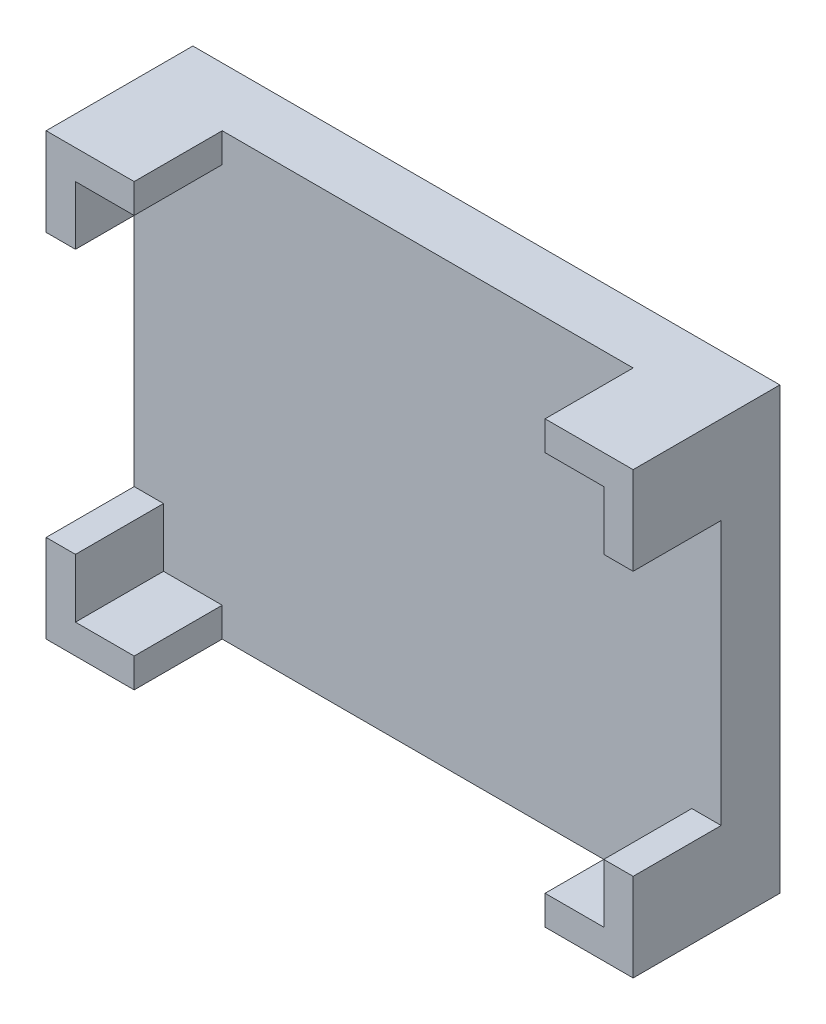
ISO-10303-21;
HEADER;
FILE_DESCRIPTION(('STEP AP214'),'2;1');
FILE_NAME('part.step','',(''),(''),'','','');
FILE_SCHEMA(('AUTOMOTIVE_DESIGN { 1 0 10303 214 1 1 1 1 }'));
ENDSEC;
DATA;
#1=APPLICATION_CONTEXT('core data for automotive mechanical design processes');
#2=APPLICATION_PROTOCOL_DEFINITION('international standard','automotive_design',2000,#1);
#3=PRODUCT_CONTEXT('',#1,'mechanical');
#4=PRODUCT('Part','Part','',(#3));
#5=PRODUCT_RELATED_PRODUCT_CATEGORY('part','',(#4));
#6=PRODUCT_DEFINITION_FORMATION('','',#4);
#7=PRODUCT_DEFINITION_CONTEXT('part definition',#1,'design');
#8=PRODUCT_DEFINITION('design','',#6,#7);
#9=PRODUCT_DEFINITION_SHAPE('','',#8);
#10=(LENGTH_UNIT() NAMED_UNIT(*) SI_UNIT(.MILLI.,.METRE.));
#11=(NAMED_UNIT(*) PLANE_ANGLE_UNIT() SI_UNIT($,.RADIAN.));
#12=(NAMED_UNIT(*) SI_UNIT($,.STERADIAN.) SOLID_ANGLE_UNIT());
#13=UNCERTAINTY_MEASURE_WITH_UNIT(LENGTH_MEASURE(1.E-05),#10,'distance_accuracy_value','');
#14=(GEOMETRIC_REPRESENTATION_CONTEXT(3) GLOBAL_UNCERTAINTY_ASSIGNED_CONTEXT((#13)) GLOBAL_UNIT_ASSIGNED_CONTEXT((#10,
#11,#12)) REPRESENTATION_CONTEXT('',''));
#15=CARTESIAN_POINT('',(0.,0.,0.));
#16=DIRECTION('',(0.,0.,1.));
#17=DIRECTION('',(1.,0.,0.));
#18=AXIS2_PLACEMENT_3D('',#15,#16,#17);
#19=CARTESIAN_POINT('',(0.,0.,2.));
#20=DIRECTION('',(0.,0.,-1.));
#21=DIRECTION('',(-1.,0.,0.));
#22=AXIS2_PLACEMENT_3D('',#19,#20,#21);
#23=PLANE('',#22);
#24=DIRECTION('',(-1.,0.,0.));
#25=VECTOR('',#24,1.);
#26=CARTESIAN_POINT('',(20.,3.,2.));
#27=LINE('',#26,#25);
#28=CARTESIAN_POINT('',(20.,3.,2.));
#29=VERTEX_POINT('',#28);
#30=CARTESIAN_POINT('',(19.,3.,2.));
#31=VERTEX_POINT('',#30);
#32=EDGE_CURVE('E210',#29,#31,#27,.T.);
#33=ORIENTED_EDGE('',*,*,#32,.F.);
#34=DIRECTION('',(0.,1.,0.));
#35=VECTOR('',#34,1.);
#36=CARTESIAN_POINT('',(20.,0.,2.));
#37=LINE('',#36,#35);
#38=CARTESIAN_POINT('',(20.,12.,2.));
#39=VERTEX_POINT('',#38);
#40=EDGE_CURVE('E198',#29,#39,#37,.T.);
#41=ORIENTED_EDGE('',*,*,#40,.T.);
#42=DIRECTION('',(-1.,0.,0.));
#43=VECTOR('',#42,1.);
#44=CARTESIAN_POINT('',(0.,12.,2.));
#45=LINE('',#44,#43);
#46=CARTESIAN_POINT('',(19.,12.,2.));
#47=VERTEX_POINT('',#46);
#48=EDGE_CURVE('E264',#39,#47,#45,.T.);
#49=ORIENTED_EDGE('',*,*,#48,.T.);
#50=DIRECTION('',(0.,-1.,0.));
#51=VECTOR('',#50,1.);
#52=CARTESIAN_POINT('',(19.,0.,2.));
#53=LINE('',#52,#51);
#54=CARTESIAN_POINT('',(19.,14.,2.));
#55=VERTEX_POINT('',#54);
#56=EDGE_CURVE('E267',#55,#47,#53,.T.);
#57=ORIENTED_EDGE('',*,*,#56,.F.);
#58=DIRECTION('',(-1.,0.,0.));
#59=VECTOR('',#58,1.);
#60=CARTESIAN_POINT('',(0.,14.,2.));
#61=LINE('',#60,#59);
#62=CARTESIAN_POINT('',(17.,14.,2.));
#63=VERTEX_POINT('',#62);
#64=EDGE_CURVE('E270',#55,#63,#61,.T.);
#65=ORIENTED_EDGE('',*,*,#64,.T.);
#66=DIRECTION('',(0.,-1.,0.));
#67=VECTOR('',#66,1.);
#68=CARTESIAN_POINT('',(17.,0.,2.));
#69=LINE('',#68,#67);
#70=CARTESIAN_POINT('',(17.,15.,2.));
#71=VERTEX_POINT('',#70);
#72=EDGE_CURVE('E261',#71,#63,#69,.T.);
#73=ORIENTED_EDGE('',*,*,#72,.F.);
#74=DIRECTION('',(-1.,0.,0.));
#75=VECTOR('',#74,1.);
#76=CARTESIAN_POINT('',(0.,15.,2.));
#77=LINE('',#76,#75);
#78=CARTESIAN_POINT('',(3.,15.,2.));
#79=VERTEX_POINT('',#78);
#80=EDGE_CURVE('E206',#71,#79,#77,.T.);
#81=ORIENTED_EDGE('',*,*,#80,.T.);
#82=DIRECTION('',(0.,-1.,0.));
#83=VECTOR('',#82,1.);
#84=CARTESIAN_POINT('',(3.,0.,2.));
#85=LINE('',#84,#83);
#86=CARTESIAN_POINT('',(3.,14.,2.));
#87=VERTEX_POINT('',#86);
#88=EDGE_CURVE('E312',#79,#87,#85,.T.);
#89=ORIENTED_EDGE('',*,*,#88,.T.);
#90=DIRECTION('',(1.,0.,0.));
#91=VECTOR('',#90,1.);
#92=CARTESIAN_POINT('',(0.,14.,2.));
#93=LINE('',#92,#91);
#94=CARTESIAN_POINT('',(1.,14.,2.));
#95=VERTEX_POINT('',#94);
#96=EDGE_CURVE('E331',#95,#87,#93,.T.);
#97=ORIENTED_EDGE('',*,*,#96,.F.);
#98=DIRECTION('',(0.,-1.,0.));
#99=VECTOR('',#98,1.);
#100=CARTESIAN_POINT('',(1.,0.,2.));
#101=LINE('',#100,#99);
#102=CARTESIAN_POINT('',(1.,12.,2.));
#103=VERTEX_POINT('',#102);
#104=EDGE_CURVE('E348',#95,#103,#101,.T.);
#105=ORIENTED_EDGE('',*,*,#104,.T.);
#106=DIRECTION('',(1.,0.,0.));
#107=VECTOR('',#106,1.);
#108=CARTESIAN_POINT('',(0.,12.,2.));
#109=LINE('',#108,#107);
#110=CARTESIAN_POINT('',(0.,12.,2.));
#111=VERTEX_POINT('',#110);
#112=EDGE_CURVE('E345',#111,#103,#109,.T.);
#113=ORIENTED_EDGE('',*,*,#112,.F.);
#114=DIRECTION('',(0.,-1.,0.));
#115=VECTOR('',#114,1.);
#116=CARTESIAN_POINT('',(0.,0.,2.));
#117=LINE('',#116,#115);
#118=CARTESIAN_POINT('',(0.,3.,2.));
#119=VERTEX_POINT('',#118);
#120=EDGE_CURVE('E367',#111,#119,#117,.T.);
#121=ORIENTED_EDGE('',*,*,#120,.T.);
#122=DIRECTION('',(1.,0.,0.));
#123=VECTOR('',#122,1.);
#124=CARTESIAN_POINT('',(0.,3.,2.));
#125=LINE('',#124,#123);
#126=CARTESIAN_POINT('',(1.,3.,2.));
#127=VERTEX_POINT('',#126);
#128=EDGE_CURVE('E301',#119,#127,#125,.T.);
#129=ORIENTED_EDGE('',*,*,#128,.T.);
#130=DIRECTION('',(0.,1.,0.));
#131=VECTOR('',#130,1.);
#132=CARTESIAN_POINT('',(1.,0.,2.));
#133=LINE('',#132,#131);
#134=CARTESIAN_POINT('',(1.,1.,2.));
#135=VERTEX_POINT('',#134);
#136=EDGE_CURVE('E303',#135,#127,#133,.T.);
#137=ORIENTED_EDGE('',*,*,#136,.F.);
#138=DIRECTION('',(1.,0.,0.));
#139=VECTOR('',#138,1.);
#140=CARTESIAN_POINT('',(0.,1.,2.));
#141=LINE('',#140,#139);
#142=CARTESIAN_POINT('',(3.,1.,2.));
#143=VERTEX_POINT('',#142);
#144=EDGE_CURVE('E307',#135,#143,#141,.T.);
#145=ORIENTED_EDGE('',*,*,#144,.T.);
#146=DIRECTION('',(0.,1.,0.));
#147=VECTOR('',#146,1.);
#148=CARTESIAN_POINT('',(3.,0.,2.));
#149=LINE('',#148,#147);
#150=CARTESIAN_POINT('',(3.,0.,2.));
#151=VERTEX_POINT('',#150);
#152=EDGE_CURVE('E309',#151,#143,#149,.T.);
#153=ORIENTED_EDGE('',*,*,#152,.F.);
#154=DIRECTION('',(1.,0.,0.));
#155=VECTOR('',#154,1.);
#156=CARTESIAN_POINT('',(0.,0.,2.));
#157=LINE('',#156,#155);
#158=CARTESIAN_POINT('',(17.,0.,2.));
#159=VERTEX_POINT('',#158);
#160=EDGE_CURVE('E207',#151,#159,#157,.T.);
#161=ORIENTED_EDGE('',*,*,#160,.T.);
#162=DIRECTION('',(0.,1.,0.));
#163=VECTOR('',#162,1.);
#164=CARTESIAN_POINT('',(17.,0.,2.));
#165=LINE('',#164,#163);
#166=CARTESIAN_POINT('',(17.,1.,2.));
#167=VERTEX_POINT('',#166);
#168=EDGE_CURVE('E231',#159,#167,#165,.T.);
#169=ORIENTED_EDGE('',*,*,#168,.T.);
#170=DIRECTION('',(-1.,0.,0.));
#171=VECTOR('',#170,1.);
#172=CARTESIAN_POINT('',(19.,1.,2.));
#173=LINE('',#172,#171);
#174=CARTESIAN_POINT('',(19.,1.,2.));
#175=VERTEX_POINT('',#174);
#176=EDGE_CURVE('E57',#175,#167,#173,.T.);
#177=ORIENTED_EDGE('',*,*,#176,.F.);
#178=DIRECTION('',(0.,1.,0.));
#179=VECTOR('',#178,1.);
#180=CARTESIAN_POINT('',(19.,1.,2.));
#181=LINE('',#180,#179);
#182=EDGE_CURVE('E52',#175,#31,#181,.T.);
#183=ORIENTED_EDGE('',*,*,#182,.T.);
#184=EDGE_LOOP('',(#33,#41,#49,#57,#65,#73,#81,#89,#97,#105,#113,#121,#129,#137,#145,#153,#161,
#169,#177,#183));
#185=FACE_BOUND('',#184,.T.);
#186=ADVANCED_FACE('F37',(#185),#23,.F.);
#187=CARTESIAN_POINT('',(0.,0.,2.));
#188=DIRECTION('',(1.,0.,0.));
#189=DIRECTION('',(0.,1.,0.));
#190=AXIS2_PLACEMENT_3D('',#187,#188,#189);
#191=PLANE('',#190);
#192=DIRECTION('',(0.,-1.,0.));
#193=VECTOR('',#192,1.);
#194=CARTESIAN_POINT('',(0.,0.,0.));
#195=LINE('',#194,#193);
#196=CARTESIAN_POINT('',(0.,15.,0.));
#197=VERTEX_POINT('',#196);
#198=CARTESIAN_POINT('',(0.,0.,0.));
#199=VERTEX_POINT('',#198);
#200=EDGE_CURVE('E366',#197,#199,#195,.T.);
#201=ORIENTED_EDGE('',*,*,#200,.T.);
#202=DIRECTION('',(0.,0.,-1.));
#203=VECTOR('',#202,1.);
#204=CARTESIAN_POINT('',(0.,0.,2.));
#205=LINE('',#204,#203);
#206=CARTESIAN_POINT('',(0.,0.,5.));
#207=VERTEX_POINT('',#206);
#208=EDGE_CURVE('E11',#207,#199,#205,.T.);
#209=ORIENTED_EDGE('',*,*,#208,.F.);
#210=DIRECTION('',(0.,-1.,0.));
#211=VECTOR('',#210,1.);
#212=CARTESIAN_POINT('',(0.,0.,5.));
#213=LINE('',#212,#211);
#214=CARTESIAN_POINT('',(0.,3.,5.));
#215=VERTEX_POINT('',#214);
#216=EDGE_CURVE('E300',#215,#207,#213,.T.);
#217=ORIENTED_EDGE('',*,*,#216,.F.);
#218=DIRECTION('',(0.,0.,-1.));
#219=VECTOR('',#218,1.);
#220=CARTESIAN_POINT('',(0.,3.,5.));
#221=LINE('',#220,#219);
#222=EDGE_CURVE('E297',#215,#119,#221,.T.);
#223=ORIENTED_EDGE('',*,*,#222,.T.);
#224=ORIENTED_EDGE('',*,*,#120,.F.);
#225=DIRECTION('',(0.,0.,-1.));
#226=VECTOR('',#225,1.);
#227=CARTESIAN_POINT('',(0.,12.,5.));
#228=LINE('',#227,#226);
#229=CARTESIAN_POINT('',(0.,12.,5.));
#230=VERTEX_POINT('',#229);
#231=EDGE_CURVE('E360',#230,#111,#228,.T.);
#232=ORIENTED_EDGE('',*,*,#231,.F.);
#233=DIRECTION('',(0.,-1.,0.));
#234=VECTOR('',#233,1.);
#235=CARTESIAN_POINT('',(0.,0.,5.));
#236=LINE('',#235,#234);
#237=CARTESIAN_POINT('',(0.,15.,5.));
#238=VERTEX_POINT('',#237);
#239=EDGE_CURVE('E334',#238,#230,#236,.T.);
#240=ORIENTED_EDGE('',*,*,#239,.F.);
#241=DIRECTION('',(0.,0.,-1.));
#242=VECTOR('',#241,1.);
#243=CARTESIAN_POINT('',(0.,15.,2.));
#244=LINE('',#243,#242);
#245=EDGE_CURVE('E372',#238,#197,#244,.T.);
#246=ORIENTED_EDGE('',*,*,#245,.T.);
#247=EDGE_LOOP('',(#201,#209,#217,#223,#224,#232,#240,#246));
#248=FACE_BOUND('',#247,.T.);
#249=ADVANCED_FACE('F39',(#248),#191,.F.);
#250=CARTESIAN_POINT('',(0.,0.,2.));
#251=DIRECTION('',(0.,1.,0.));
#252=DIRECTION('',(0.,0.,1.));
#253=AXIS2_PLACEMENT_3D('',#250,#251,#252);
#254=PLANE('',#253);
#255=DIRECTION('',(1.,0.,0.));
#256=VECTOR('',#255,1.);
#257=CARTESIAN_POINT('',(0.,0.,0.));
#258=LINE('',#257,#256);
#259=CARTESIAN_POINT('',(20.,0.,0.));
#260=VERTEX_POINT('',#259);
#261=EDGE_CURVE('E375',#199,#260,#258,.T.);
#262=ORIENTED_EDGE('',*,*,#261,.T.);
#263=DIRECTION('',(0.,0.,-1.));
#264=VECTOR('',#263,1.);
#265=CARTESIAN_POINT('',(20.,0.,2.));
#266=LINE('',#265,#264);
#267=CARTESIAN_POINT('',(20.,0.,5.));
#268=VERTEX_POINT('',#267);
#269=EDGE_CURVE('E45',#268,#260,#266,.T.);
#270=ORIENTED_EDGE('',*,*,#269,.F.);
#271=DIRECTION('',(-1.,0.,0.));
#272=VECTOR('',#271,1.);
#273=CARTESIAN_POINT('',(20.,0.,5.));
#274=LINE('',#273,#272);
#275=CARTESIAN_POINT('',(17.,0.,5.));
#276=VERTEX_POINT('',#275);
#277=EDGE_CURVE('E230',#268,#276,#274,.T.);
#278=ORIENTED_EDGE('',*,*,#277,.T.);
#279=DIRECTION('',(0.,0.,-1.));
#280=VECTOR('',#279,1.);
#281=CARTESIAN_POINT('',(17.,0.,5.));
#282=LINE('',#281,#280);
#283=EDGE_CURVE('E227',#276,#159,#282,.T.);
#284=ORIENTED_EDGE('',*,*,#283,.T.);
#285=ORIENTED_EDGE('',*,*,#160,.F.);
#286=DIRECTION('',(0.,0.,-1.));
#287=VECTOR('',#286,1.);
#288=CARTESIAN_POINT('',(3.,0.,5.));
#289=LINE('',#288,#287);
#290=CARTESIAN_POINT('',(3.,0.,5.));
#291=VERTEX_POINT('',#290);
#292=EDGE_CURVE('E272',#291,#151,#289,.T.);
#293=ORIENTED_EDGE('',*,*,#292,.F.);
#294=DIRECTION('',(1.,0.,0.));
#295=VECTOR('',#294,1.);
#296=CARTESIAN_POINT('',(0.,0.,5.));
#297=LINE('',#296,#295);
#298=EDGE_CURVE('E304',#207,#291,#297,.T.);
#299=ORIENTED_EDGE('',*,*,#298,.F.);
#300=ORIENTED_EDGE('',*,*,#208,.T.);
#301=EDGE_LOOP('',(#262,#270,#278,#284,#285,#293,#299,#300));
#302=FACE_BOUND('',#301,.T.);
#303=ADVANCED_FACE('F446',(#302),#254,.F.);
#304=CARTESIAN_POINT('',(20.,0.,2.));
#305=DIRECTION('',(-1.,0.,0.));
#306=DIRECTION('',(0.,-1.,0.));
#307=AXIS2_PLACEMENT_3D('',#304,#305,#306);
#308=PLANE('',#307);
#309=DIRECTION('',(0.,1.,0.));
#310=VECTOR('',#309,1.);
#311=CARTESIAN_POINT('',(20.,0.,0.));
#312=LINE('',#311,#310);
#313=CARTESIAN_POINT('',(20.,15.,0.));
#314=VERTEX_POINT('',#313);
#315=EDGE_CURVE('E377',#260,#314,#312,.T.);
#316=ORIENTED_EDGE('',*,*,#315,.T.);
#317=DIRECTION('',(0.,0.,-1.));
#318=VECTOR('',#317,1.);
#319=CARTESIAN_POINT('',(20.,15.,2.));
#320=LINE('',#319,#318);
#321=CARTESIAN_POINT('',(20.,15.,5.));
#322=VERTEX_POINT('',#321);
#323=EDGE_CURVE('E382',#322,#314,#320,.T.);
#324=ORIENTED_EDGE('',*,*,#323,.F.);
#325=DIRECTION('',(0.,1.,0.));
#326=VECTOR('',#325,1.);
#327=CARTESIAN_POINT('',(20.,0.,5.));
#328=LINE('',#327,#326);
#329=CARTESIAN_POINT('',(20.,12.,5.));
#330=VERTEX_POINT('',#329);
#331=EDGE_CURVE('E276',#330,#322,#328,.T.);
#332=ORIENTED_EDGE('',*,*,#331,.F.);
#333=DIRECTION('',(0.,0.,-1.));
#334=VECTOR('',#333,1.);
#335=CARTESIAN_POINT('',(20.,12.,5.));
#336=LINE('',#335,#334);
#337=EDGE_CURVE('E204',#330,#39,#336,.T.);
#338=ORIENTED_EDGE('',*,*,#337,.T.);
#339=ORIENTED_EDGE('',*,*,#40,.F.);
#340=DIRECTION('',(0.,0.,-1.));
#341=VECTOR('',#340,1.);
#342=CARTESIAN_POINT('',(20.,3.,5.));
#343=LINE('',#342,#341);
#344=CARTESIAN_POINT('',(20.,3.,5.));
#345=VERTEX_POINT('',#344);
#346=EDGE_CURVE('E202',#345,#29,#343,.T.);
#347=ORIENTED_EDGE('',*,*,#346,.F.);
#348=DIRECTION('',(0.,1.,0.));
#349=VECTOR('',#348,1.);
#350=CARTESIAN_POINT('',(20.,0.,5.));
#351=LINE('',#350,#349);
#352=EDGE_CURVE('E233',#268,#345,#351,.T.);
#353=ORIENTED_EDGE('',*,*,#352,.F.);
#354=ORIENTED_EDGE('',*,*,#269,.T.);
#355=EDGE_LOOP('',(#316,#324,#332,#338,#339,#347,#353,#354));
#356=FACE_BOUND('',#355,.T.);
#357=ADVANCED_FACE('F199',(#356),#308,.F.);
#358=CARTESIAN_POINT('',(0.,15.,2.));
#359=DIRECTION('',(0.,-1.,0.));
#360=DIRECTION('',(0.,0.,-1.));
#361=AXIS2_PLACEMENT_3D('',#358,#359,#360);
#362=PLANE('',#361);
#363=DIRECTION('',(-1.,0.,0.));
#364=VECTOR('',#363,1.);
#365=CARTESIAN_POINT('',(0.,15.,0.));
#366=LINE('',#365,#364);
#367=EDGE_CURVE('E369',#314,#197,#366,.T.);
#368=ORIENTED_EDGE('',*,*,#367,.T.);
#369=ORIENTED_EDGE('',*,*,#245,.F.);
#370=DIRECTION('',(-1.,0.,0.));
#371=VECTOR('',#370,1.);
#372=CARTESIAN_POINT('',(0.,15.,5.));
#373=LINE('',#372,#371);
#374=CARTESIAN_POINT('',(3.,15.,5.));
#375=VERTEX_POINT('',#374);
#376=EDGE_CURVE('E330',#375,#238,#373,.T.);
#377=ORIENTED_EDGE('',*,*,#376,.F.);
#378=DIRECTION('',(0.,0.,-1.));
#379=VECTOR('',#378,1.);
#380=CARTESIAN_POINT('',(3.,15.,5.));
#381=LINE('',#380,#379);
#382=EDGE_CURVE('E363',#375,#79,#381,.T.);
#383=ORIENTED_EDGE('',*,*,#382,.T.);
#384=ORIENTED_EDGE('',*,*,#80,.F.);
#385=DIRECTION('',(0.,0.,-1.));
#386=VECTOR('',#385,1.);
#387=CARTESIAN_POINT('',(17.,15.,5.));
#388=LINE('',#387,#386);
#389=CARTESIAN_POINT('',(17.,15.,5.));
#390=VERTEX_POINT('',#389);
#391=EDGE_CURVE('E254',#390,#71,#388,.T.);
#392=ORIENTED_EDGE('',*,*,#391,.F.);
#393=DIRECTION('',(-1.,0.,0.));
#394=VECTOR('',#393,1.);
#395=CARTESIAN_POINT('',(0.,15.,5.));
#396=LINE('',#395,#394);
#397=EDGE_CURVE('E274',#322,#390,#396,.T.);
#398=ORIENTED_EDGE('',*,*,#397,.F.);
#399=ORIENTED_EDGE('',*,*,#323,.T.);
#400=EDGE_LOOP('',(#368,#369,#377,#383,#384,#392,#398,#399));
#401=FACE_BOUND('',#400,.T.);
#402=ADVANCED_FACE('F393',(#401),#362,.F.);
#403=CARTESIAN_POINT('',(0.,0.,0.));
#404=DIRECTION('',(0.,0.,-1.));
#405=DIRECTION('',(-1.,0.,0.));
#406=AXIS2_PLACEMENT_3D('',#403,#404,#405);
#407=PLANE('',#406);
#408=ORIENTED_EDGE('',*,*,#200,.F.);
#409=ORIENTED_EDGE('',*,*,#367,.F.);
#410=ORIENTED_EDGE('',*,*,#315,.F.);
#411=ORIENTED_EDGE('',*,*,#261,.F.);
#412=EDGE_LOOP('',(#408,#409,#410,#411));
#413=FACE_BOUND('',#412,.T.);
#414=ADVANCED_FACE('F391',(#413),#407,.T.);
#415=CARTESIAN_POINT('',(3.,0.,5.));
#416=DIRECTION('',(1.,0.,0.));
#417=DIRECTION('',(0.,0.,-1.));
#418=AXIS2_PLACEMENT_3D('',#415,#416,#417);
#419=PLANE('',#418);
#420=ORIENTED_EDGE('',*,*,#88,.F.);
#421=ORIENTED_EDGE('',*,*,#382,.F.);
#422=DIRECTION('',(0.,-1.,0.));
#423=VECTOR('',#422,1.);
#424=CARTESIAN_POINT('',(3.,0.,5.));
#425=LINE('',#424,#423);
#426=CARTESIAN_POINT('',(3.,14.,5.));
#427=VERTEX_POINT('',#426);
#428=EDGE_CURVE('E327',#375,#427,#425,.T.);
#429=ORIENTED_EDGE('',*,*,#428,.T.);
#430=DIRECTION('',(0.,0.,-1.));
#431=VECTOR('',#430,1.);
#432=CARTESIAN_POINT('',(3.,14.,5.));
#433=LINE('',#432,#431);
#434=EDGE_CURVE('E343',#427,#87,#433,.T.);
#435=ORIENTED_EDGE('',*,*,#434,.T.);
#436=EDGE_LOOP('',(#420,#421,#429,#435));
#437=FACE_BOUND('',#436,.T.);
#438=ADVANCED_FACE('F410',(#437),#419,.T.);
#439=CARTESIAN_POINT('',(0.,12.,5.));
#440=DIRECTION('',(0.,1.,0.));
#441=DIRECTION('',(0.,0.,1.));
#442=AXIS2_PLACEMENT_3D('',#439,#440,#441);
#443=PLANE('',#442);
#444=ORIENTED_EDGE('',*,*,#112,.T.);
#445=DIRECTION('',(0.,0.,-1.));
#446=VECTOR('',#445,1.);
#447=CARTESIAN_POINT('',(1.,12.,5.));
#448=LINE('',#447,#446);
#449=CARTESIAN_POINT('',(1.,12.,5.));
#450=VERTEX_POINT('',#449);
#451=EDGE_CURVE('E357',#450,#103,#448,.T.);
#452=ORIENTED_EDGE('',*,*,#451,.F.);
#453=DIRECTION('',(1.,0.,0.));
#454=VECTOR('',#453,1.);
#455=CARTESIAN_POINT('',(0.,12.,5.));
#456=LINE('',#455,#454);
#457=EDGE_CURVE('E336',#230,#450,#456,.T.);
#458=ORIENTED_EDGE('',*,*,#457,.F.);
#459=ORIENTED_EDGE('',*,*,#231,.T.);
#460=EDGE_LOOP('',(#444,#452,#458,#459));
#461=FACE_BOUND('',#460,.T.);
#462=ADVANCED_FACE('F468',(#461),#443,.F.);
#463=CARTESIAN_POINT('',(1.,0.,5.));
#464=DIRECTION('',(1.,0.,0.));
#465=DIRECTION('',(0.,1.,0.));
#466=AXIS2_PLACEMENT_3D('',#463,#464,#465);
#467=PLANE('',#466);
#468=ORIENTED_EDGE('',*,*,#104,.F.);
#469=DIRECTION('',(0.,0.,-1.));
#470=VECTOR('',#469,1.);
#471=CARTESIAN_POINT('',(1.,14.,5.));
#472=LINE('',#471,#470);
#473=CARTESIAN_POINT('',(1.,14.,5.));
#474=VERTEX_POINT('',#473);
#475=EDGE_CURVE('E354',#474,#95,#472,.T.);
#476=ORIENTED_EDGE('',*,*,#475,.F.);
#477=DIRECTION('',(0.,-1.,0.));
#478=VECTOR('',#477,1.);
#479=CARTESIAN_POINT('',(1.,0.,5.));
#480=LINE('',#479,#478);
#481=EDGE_CURVE('E338',#474,#450,#480,.T.);
#482=ORIENTED_EDGE('',*,*,#481,.T.);
#483=ORIENTED_EDGE('',*,*,#451,.T.);
#484=EDGE_LOOP('',(#468,#476,#482,#483));
#485=FACE_BOUND('',#484,.T.);
#486=ADVANCED_FACE('F471',(#485),#467,.T.);
#487=CARTESIAN_POINT('',(0.,14.,5.));
#488=DIRECTION('',(0.,1.,0.));
#489=DIRECTION('',(0.,0.,1.));
#490=AXIS2_PLACEMENT_3D('',#487,#488,#489);
#491=PLANE('',#490);
#492=ORIENTED_EDGE('',*,*,#96,.T.);
#493=ORIENTED_EDGE('',*,*,#434,.F.);
#494=DIRECTION('',(1.,0.,0.));
#495=VECTOR('',#494,1.);
#496=CARTESIAN_POINT('',(0.,14.,5.));
#497=LINE('',#496,#495);
#498=EDGE_CURVE('E341',#474,#427,#497,.T.);
#499=ORIENTED_EDGE('',*,*,#498,.F.);
#500=ORIENTED_EDGE('',*,*,#475,.T.);
#501=EDGE_LOOP('',(#492,#493,#499,#500));
#502=FACE_BOUND('',#501,.T.);
#503=ADVANCED_FACE('F474',(#502),#491,.F.);
#504=CARTESIAN_POINT('',(0.,0.,5.));
#505=DIRECTION('',(0.,0.,1.));
#506=DIRECTION('',(1.,0.,0.));
#507=AXIS2_PLACEMENT_3D('',#504,#505,#506);
#508=PLANE('',#507);
#509=ORIENTED_EDGE('',*,*,#428,.F.);
#510=ORIENTED_EDGE('',*,*,#376,.T.);
#511=ORIENTED_EDGE('',*,*,#239,.T.);
#512=ORIENTED_EDGE('',*,*,#457,.T.);
#513=ORIENTED_EDGE('',*,*,#481,.F.);
#514=ORIENTED_EDGE('',*,*,#498,.T.);
#515=EDGE_LOOP('',(#509,#510,#511,#512,#513,#514));
#516=FACE_BOUND('',#515,.T.);
#517=ADVANCED_FACE('F403',(#516),#508,.T.);
#518=CARTESIAN_POINT('',(3.,0.,5.));
#519=DIRECTION('',(-1.,0.,0.));
#520=DIRECTION('',(0.,0.,1.));
#521=AXIS2_PLACEMENT_3D('',#518,#519,#520);
#522=PLANE('',#521);
#523=ORIENTED_EDGE('',*,*,#152,.T.);
#524=DIRECTION('',(0.,0.,-1.));
#525=VECTOR('',#524,1.);
#526=CARTESIAN_POINT('',(3.,1.,5.));
#527=LINE('',#526,#525);
#528=CARTESIAN_POINT('',(3.,1.,5.));
#529=VERTEX_POINT('',#528);
#530=EDGE_CURVE('E288',#529,#143,#527,.T.);
#531=ORIENTED_EDGE('',*,*,#530,.F.);
#532=DIRECTION('',(0.,1.,0.));
#533=VECTOR('',#532,1.);
#534=CARTESIAN_POINT('',(3.,0.,5.));
#535=LINE('',#534,#533);
#536=EDGE_CURVE('E323',#291,#529,#535,.T.);
#537=ORIENTED_EDGE('',*,*,#536,.F.);
#538=ORIENTED_EDGE('',*,*,#292,.T.);
#539=EDGE_LOOP('',(#523,#531,#537,#538));
#540=FACE_BOUND('',#539,.T.);
#541=ADVANCED_FACE('F481',(#540),#522,.F.);
#542=CARTESIAN_POINT('',(0.,1.,5.));
#543=DIRECTION('',(0.,1.,0.));
#544=DIRECTION('',(0.,0.,1.));
#545=AXIS2_PLACEMENT_3D('',#542,#543,#544);
#546=PLANE('',#545);
#547=ORIENTED_EDGE('',*,*,#144,.F.);
#548=DIRECTION('',(0.,0.,-1.));
#549=VECTOR('',#548,1.);
#550=CARTESIAN_POINT('',(1.,1.,5.));
#551=LINE('',#550,#549);
#552=CARTESIAN_POINT('',(1.,1.,5.));
#553=VERTEX_POINT('',#552);
#554=EDGE_CURVE('E291',#553,#135,#551,.T.);
#555=ORIENTED_EDGE('',*,*,#554,.F.);
#556=DIRECTION('',(1.,0.,0.));
#557=VECTOR('',#556,1.);
#558=CARTESIAN_POINT('',(0.,1.,5.));
#559=LINE('',#558,#557);
#560=EDGE_CURVE('E320',#553,#529,#559,.T.);
#561=ORIENTED_EDGE('',*,*,#560,.T.);
#562=ORIENTED_EDGE('',*,*,#530,.T.);
#563=EDGE_LOOP('',(#547,#555,#561,#562));
#564=FACE_BOUND('',#563,.T.);
#565=ADVANCED_FACE('F602',(#564),#546,.T.);
#566=CARTESIAN_POINT('',(1.,0.,5.));
#567=DIRECTION('',(-1.,0.,0.));
#568=DIRECTION('',(0.,0.,1.));
#569=AXIS2_PLACEMENT_3D('',#566,#567,#568);
#570=PLANE('',#569);
#571=ORIENTED_EDGE('',*,*,#136,.T.);
#572=DIRECTION('',(0.,0.,-1.));
#573=VECTOR('',#572,1.);
#574=CARTESIAN_POINT('',(1.,3.,5.));
#575=LINE('',#574,#573);
#576=CARTESIAN_POINT('',(1.,3.,5.));
#577=VERTEX_POINT('',#576);
#578=EDGE_CURVE('E294',#577,#127,#575,.T.);
#579=ORIENTED_EDGE('',*,*,#578,.F.);
#580=DIRECTION('',(0.,1.,0.));
#581=VECTOR('',#580,1.);
#582=CARTESIAN_POINT('',(1.,0.,5.));
#583=LINE('',#582,#581);
#584=EDGE_CURVE('E318',#553,#577,#583,.T.);
#585=ORIENTED_EDGE('',*,*,#584,.F.);
#586=ORIENTED_EDGE('',*,*,#554,.T.);
#587=EDGE_LOOP('',(#571,#579,#585,#586));
#588=FACE_BOUND('',#587,.T.);
#589=ADVANCED_FACE('F611',(#588),#570,.F.);
#590=CARTESIAN_POINT('',(0.,3.,5.));
#591=DIRECTION('',(0.,1.,0.));
#592=DIRECTION('',(0.,0.,1.));
#593=AXIS2_PLACEMENT_3D('',#590,#591,#592);
#594=PLANE('',#593);
#595=ORIENTED_EDGE('',*,*,#128,.F.);
#596=ORIENTED_EDGE('',*,*,#222,.F.);
#597=DIRECTION('',(1.,0.,0.));
#598=VECTOR('',#597,1.);
#599=CARTESIAN_POINT('',(0.,3.,5.));
#600=LINE('',#599,#598);
#601=EDGE_CURVE('E315',#215,#577,#600,.T.);
#602=ORIENTED_EDGE('',*,*,#601,.T.);
#603=ORIENTED_EDGE('',*,*,#578,.T.);
#604=EDGE_LOOP('',(#595,#596,#602,#603));
#605=FACE_BOUND('',#604,.T.);
#606=ADVANCED_FACE('F437',(#605),#594,.T.);
#607=CARTESIAN_POINT('',(0.,0.,5.));
#608=DIRECTION('',(0.,0.,1.));
#609=DIRECTION('',(1.,0.,0.));
#610=AXIS2_PLACEMENT_3D('',#607,#608,#609);
#611=PLANE('',#610);
#612=ORIENTED_EDGE('',*,*,#298,.T.);
#613=ORIENTED_EDGE('',*,*,#536,.T.);
#614=ORIENTED_EDGE('',*,*,#560,.F.);
#615=ORIENTED_EDGE('',*,*,#584,.T.);
#616=ORIENTED_EDGE('',*,*,#601,.F.);
#617=ORIENTED_EDGE('',*,*,#216,.T.);
#618=EDGE_LOOP('',(#612,#613,#614,#615,#616,#617));
#619=FACE_BOUND('',#618,.T.);
#620=ADVANCED_FACE('F430',(#619),#611,.T.);
#621=CARTESIAN_POINT('',(0.,14.,5.));
#622=DIRECTION('',(0.,-1.,0.));
#623=DIRECTION('',(0.,0.,-1.));
#624=AXIS2_PLACEMENT_3D('',#621,#622,#623);
#625=PLANE('',#624);
#626=ORIENTED_EDGE('',*,*,#64,.F.);
#627=DIRECTION('',(0.,0.,-1.));
#628=VECTOR('',#627,1.);
#629=CARTESIAN_POINT('',(19.,14.,5.));
#630=LINE('',#629,#628);
#631=CARTESIAN_POINT('',(19.,14.,5.));
#632=VERTEX_POINT('',#631);
#633=EDGE_CURVE('E213',#632,#55,#630,.T.);
#634=ORIENTED_EDGE('',*,*,#633,.F.);
#635=DIRECTION('',(-1.,0.,0.));
#636=VECTOR('',#635,1.);
#637=CARTESIAN_POINT('',(0.,14.,5.));
#638=LINE('',#637,#636);
#639=CARTESIAN_POINT('',(17.,14.,5.));
#640=VERTEX_POINT('',#639);
#641=EDGE_CURVE('E265',#632,#640,#638,.T.);
#642=ORIENTED_EDGE('',*,*,#641,.T.);
#643=DIRECTION('',(0.,0.,-1.));
#644=VECTOR('',#643,1.);
#645=CARTESIAN_POINT('',(17.,14.,5.));
#646=LINE('',#645,#644);
#647=EDGE_CURVE('E257',#640,#63,#646,.T.);
#648=ORIENTED_EDGE('',*,*,#647,.T.);
#649=EDGE_LOOP('',(#626,#634,#642,#648));
#650=FACE_BOUND('',#649,.T.);
#651=ADVANCED_FACE('F428',(#650),#625,.T.);
#652=CARTESIAN_POINT('',(19.,0.,5.));
#653=DIRECTION('',(1.,0.,0.));
#654=DIRECTION('',(0.,0.,-1.));
#655=AXIS2_PLACEMENT_3D('',#652,#653,#654);
#656=PLANE('',#655);
#657=ORIENTED_EDGE('',*,*,#56,.T.);
#658=DIRECTION('',(0.,0.,-1.));
#659=VECTOR('',#658,1.);
#660=CARTESIAN_POINT('',(19.,12.,5.));
#661=LINE('',#660,#659);
#662=CARTESIAN_POINT('',(19.,12.,5.));
#663=VERTEX_POINT('',#662);
#664=EDGE_CURVE('E250',#663,#47,#661,.T.);
#665=ORIENTED_EDGE('',*,*,#664,.F.);
#666=DIRECTION('',(0.,-1.,0.));
#667=VECTOR('',#666,1.);
#668=CARTESIAN_POINT('',(19.,0.,5.));
#669=LINE('',#668,#667);
#670=EDGE_CURVE('E282',#632,#663,#669,.T.);
#671=ORIENTED_EDGE('',*,*,#670,.F.);
#672=ORIENTED_EDGE('',*,*,#633,.T.);
#673=EDGE_LOOP('',(#657,#665,#671,#672));
#674=FACE_BOUND('',#673,.T.);
#675=ADVANCED_FACE('F426',(#674),#656,.F.);
#676=CARTESIAN_POINT('',(0.,12.,5.));
#677=DIRECTION('',(0.,-1.,0.));
#678=DIRECTION('',(0.,0.,-1.));
#679=AXIS2_PLACEMENT_3D('',#676,#677,#678);
#680=PLANE('',#679);
#681=ORIENTED_EDGE('',*,*,#48,.F.);
#682=ORIENTED_EDGE('',*,*,#337,.F.);
#683=DIRECTION('',(-1.,0.,0.));
#684=VECTOR('',#683,1.);
#685=CARTESIAN_POINT('',(0.,12.,5.));
#686=LINE('',#685,#684);
#687=EDGE_CURVE('E279',#330,#663,#686,.T.);
#688=ORIENTED_EDGE('',*,*,#687,.T.);
#689=ORIENTED_EDGE('',*,*,#664,.T.);
#690=EDGE_LOOP('',(#681,#682,#688,#689));
#691=FACE_BOUND('',#690,.T.);
#692=ADVANCED_FACE('F424',(#691),#680,.T.);
#693=CARTESIAN_POINT('',(17.,0.,5.));
#694=DIRECTION('',(1.,0.,0.));
#695=DIRECTION('',(0.,1.,0.));
#696=AXIS2_PLACEMENT_3D('',#693,#694,#695);
#697=PLANE('',#696);
#698=ORIENTED_EDGE('',*,*,#72,.T.);
#699=ORIENTED_EDGE('',*,*,#647,.F.);
#700=DIRECTION('',(0.,-1.,0.));
#701=VECTOR('',#700,1.);
#702=CARTESIAN_POINT('',(17.,0.,5.));
#703=LINE('',#702,#701);
#704=EDGE_CURVE('E260',#390,#640,#703,.T.);
#705=ORIENTED_EDGE('',*,*,#704,.F.);
#706=ORIENTED_EDGE('',*,*,#391,.T.);
#707=EDGE_LOOP('',(#698,#699,#705,#706));
#708=FACE_BOUND('',#707,.T.);
#709=ADVANCED_FACE('F416',(#708),#697,.F.);
#710=CARTESIAN_POINT('',(0.,0.,5.));
#711=DIRECTION('',(0.,0.,1.));
#712=DIRECTION('',(1.,0.,0.));
#713=AXIS2_PLACEMENT_3D('',#710,#711,#712);
#714=PLANE('',#713);
#715=ORIENTED_EDGE('',*,*,#641,.F.);
#716=ORIENTED_EDGE('',*,*,#670,.T.);
#717=ORIENTED_EDGE('',*,*,#687,.F.);
#718=ORIENTED_EDGE('',*,*,#331,.T.);
#719=ORIENTED_EDGE('',*,*,#397,.T.);
#720=ORIENTED_EDGE('',*,*,#704,.T.);
#721=EDGE_LOOP('',(#715,#716,#717,#718,#719,#720));
#722=FACE_BOUND('',#721,.T.);
#723=ADVANCED_FACE('F419',(#722),#714,.T.);
#724=CARTESIAN_POINT('',(20.,3.,5.));
#725=DIRECTION('',(0.,-1.,0.));
#726=DIRECTION('',(0.,0.,-1.));
#727=AXIS2_PLACEMENT_3D('',#724,#725,#726);
#728=PLANE('',#727);
#729=ORIENTED_EDGE('',*,*,#32,.T.);
#730=DIRECTION('',(0.,0.,-1.));
#731=VECTOR('',#730,1.);
#732=CARTESIAN_POINT('',(19.,3.,5.));
#733=LINE('',#732,#731);
#734=CARTESIAN_POINT('',(19.,3.,5.));
#735=VERTEX_POINT('',#734);
#736=EDGE_CURVE('E218',#735,#31,#733,.T.);
#737=ORIENTED_EDGE('',*,*,#736,.F.);
#738=DIRECTION('',(-1.,0.,0.));
#739=VECTOR('',#738,1.);
#740=CARTESIAN_POINT('',(20.,3.,5.));
#741=LINE('',#740,#739);
#742=EDGE_CURVE('E216',#345,#735,#741,.T.);
#743=ORIENTED_EDGE('',*,*,#742,.F.);
#744=ORIENTED_EDGE('',*,*,#346,.T.);
#745=EDGE_LOOP('',(#729,#737,#743,#744));
#746=FACE_BOUND('',#745,.T.);
#747=ADVANCED_FACE('F215',(#746),#728,.F.);
#748=CARTESIAN_POINT('',(19.,1.,5.));
#749=DIRECTION('',(-1.,0.,0.));
#750=DIRECTION('',(0.,0.,1.));
#751=AXIS2_PLACEMENT_3D('',#748,#749,#750);
#752=PLANE('',#751);
#753=ORIENTED_EDGE('',*,*,#182,.F.);
#754=DIRECTION('',(0.,0.,-1.));
#755=VECTOR('',#754,1.);
#756=CARTESIAN_POINT('',(19.,1.,5.));
#757=LINE('',#756,#755);
#758=CARTESIAN_POINT('',(19.,1.,5.));
#759=VERTEX_POINT('',#758);
#760=EDGE_CURVE('E220',#759,#175,#757,.T.);
#761=ORIENTED_EDGE('',*,*,#760,.F.);
#762=DIRECTION('',(0.,1.,0.));
#763=VECTOR('',#762,1.);
#764=CARTESIAN_POINT('',(19.,1.,5.));
#765=LINE('',#764,#763);
#766=EDGE_CURVE('E243',#759,#735,#765,.T.);
#767=ORIENTED_EDGE('',*,*,#766,.T.);
#768=ORIENTED_EDGE('',*,*,#736,.T.);
#769=EDGE_LOOP('',(#753,#761,#767,#768));
#770=FACE_BOUND('',#769,.T.);
#771=ADVANCED_FACE('F670',(#770),#752,.T.);
#772=CARTESIAN_POINT('',(19.,1.,5.));
#773=DIRECTION('',(0.,-1.,0.));
#774=DIRECTION('',(1.,0.,0.));
#775=AXIS2_PLACEMENT_3D('',#772,#773,#774);
#776=PLANE('',#775);
#777=ORIENTED_EDGE('',*,*,#176,.T.);
#778=DIRECTION('',(0.,0.,-1.));
#779=VECTOR('',#778,1.);
#780=CARTESIAN_POINT('',(17.,1.,5.));
#781=LINE('',#780,#779);
#782=CARTESIAN_POINT('',(17.,1.,5.));
#783=VERTEX_POINT('',#782);
#784=EDGE_CURVE('E224',#783,#167,#781,.T.);
#785=ORIENTED_EDGE('',*,*,#784,.F.);
#786=DIRECTION('',(-1.,0.,0.));
#787=VECTOR('',#786,1.);
#788=CARTESIAN_POINT('',(19.,1.,5.));
#789=LINE('',#788,#787);
#790=EDGE_CURVE('E241',#759,#783,#789,.T.);
#791=ORIENTED_EDGE('',*,*,#790,.F.);
#792=ORIENTED_EDGE('',*,*,#760,.T.);
#793=EDGE_LOOP('',(#777,#785,#791,#792));
#794=FACE_BOUND('',#793,.T.);
#795=ADVANCED_FACE('F678',(#794),#776,.F.);
#796=CARTESIAN_POINT('',(17.,0.,5.));
#797=DIRECTION('',(-1.,0.,0.));
#798=DIRECTION('',(0.,0.,1.));
#799=AXIS2_PLACEMENT_3D('',#796,#797,#798);
#800=PLANE('',#799);
#801=ORIENTED_EDGE('',*,*,#168,.F.);
#802=ORIENTED_EDGE('',*,*,#283,.F.);
#803=DIRECTION('',(0.,1.,0.));
#804=VECTOR('',#803,1.);
#805=CARTESIAN_POINT('',(17.,0.,5.));
#806=LINE('',#805,#804);
#807=EDGE_CURVE('E238',#276,#783,#806,.T.);
#808=ORIENTED_EDGE('',*,*,#807,.T.);
#809=ORIENTED_EDGE('',*,*,#784,.T.);
#810=EDGE_LOOP('',(#801,#802,#808,#809));
#811=FACE_BOUND('',#810,.T.);
#812=ADVANCED_FACE('F687',(#811),#800,.T.);
#813=CARTESIAN_POINT('',(0.,0.,5.));
#814=DIRECTION('',(0.,0.,1.));
#815=DIRECTION('',(1.,0.,0.));
#816=AXIS2_PLACEMENT_3D('',#813,#814,#815);
#817=PLANE('',#816);
#818=ORIENTED_EDGE('',*,*,#352,.T.);
#819=ORIENTED_EDGE('',*,*,#742,.T.);
#820=ORIENTED_EDGE('',*,*,#766,.F.);
#821=ORIENTED_EDGE('',*,*,#790,.T.);
#822=ORIENTED_EDGE('',*,*,#807,.F.);
#823=ORIENTED_EDGE('',*,*,#277,.F.);
#824=EDGE_LOOP('',(#818,#819,#820,#821,#822,#823));
#825=FACE_BOUND('',#824,.T.);
#826=ADVANCED_FACE('F696',(#825),#817,.T.);
#827=CLOSED_SHELL('',(#186,#249,#303,#357,#402,#414,#438,#462,#486,#503,#517,#541,#565,#589,
#606,#620,#651,#675,#692,#709,#723,#747,#771,#795,#812,#826));
#828=MANIFOLD_SOLID_BREP('B2',#827);
#829=ADVANCED_BREP_SHAPE_REPRESENTATION('',(#18,#828),#14);
#830=SHAPE_DEFINITION_REPRESENTATION(#9,#829);
ENDSEC;
END-ISO-10303-21;
